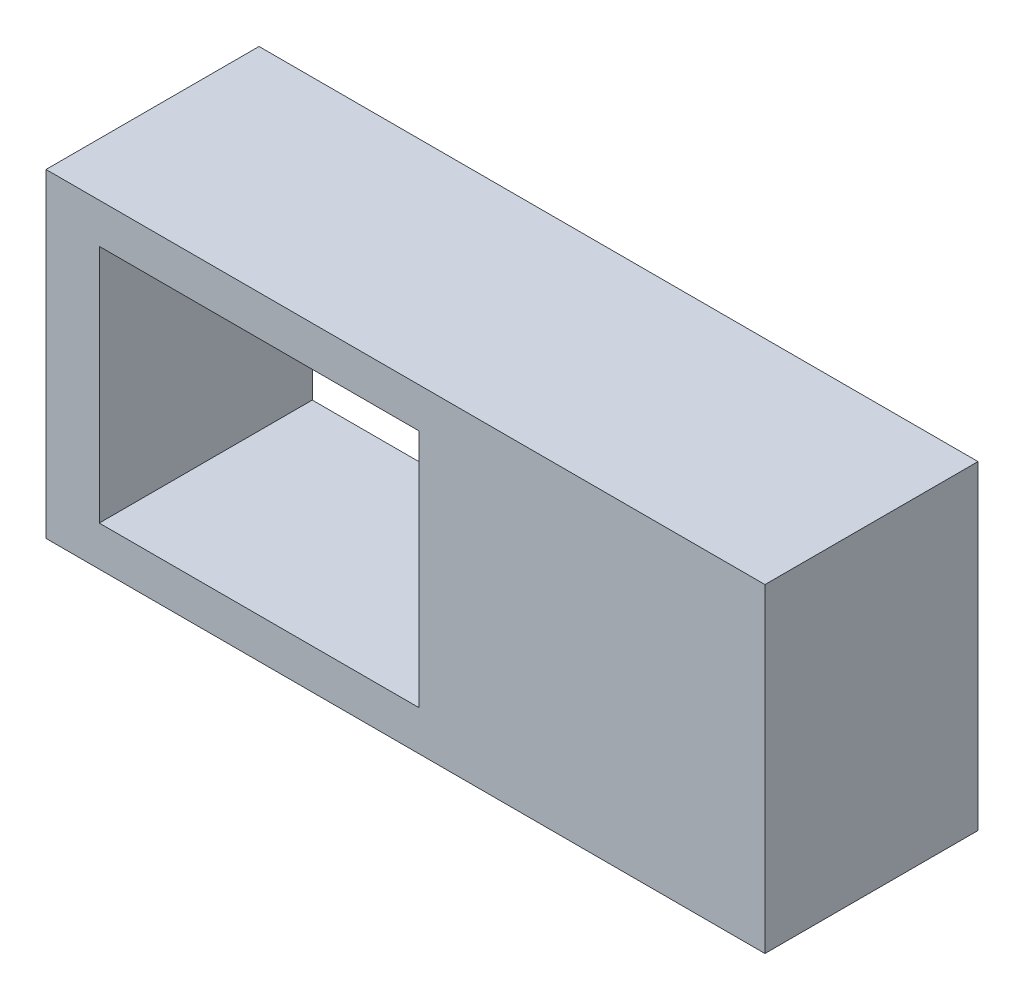
ISO-10303-21;
HEADER;
FILE_DESCRIPTION(('STEP AP214'),'2;1');
FILE_NAME('part.step','',(''),(''),'','','');
FILE_SCHEMA(('AUTOMOTIVE_DESIGN { 1 0 10303 214 1 1 1 1 }'));
ENDSEC;
DATA;
#1=APPLICATION_CONTEXT('core data for automotive mechanical design processes');
#2=APPLICATION_PROTOCOL_DEFINITION('international standard','automotive_design',2000,#1);
#3=PRODUCT_CONTEXT('',#1,'mechanical');
#4=PRODUCT('Part','Part','',(#3));
#5=PRODUCT_RELATED_PRODUCT_CATEGORY('part','',(#4));
#6=PRODUCT_DEFINITION_FORMATION('','',#4);
#7=PRODUCT_DEFINITION_CONTEXT('part definition',#1,'design');
#8=PRODUCT_DEFINITION('design','',#6,#7);
#9=PRODUCT_DEFINITION_SHAPE('','',#8);
#10=(LENGTH_UNIT() NAMED_UNIT(*) SI_UNIT(.MILLI.,.METRE.));
#11=(NAMED_UNIT(*) PLANE_ANGLE_UNIT() SI_UNIT($,.RADIAN.));
#12=(NAMED_UNIT(*) SI_UNIT($,.STERADIAN.) SOLID_ANGLE_UNIT());
#13=UNCERTAINTY_MEASURE_WITH_UNIT(LENGTH_MEASURE(1.E-05),#10,'distance_accuracy_value','');
#14=(GEOMETRIC_REPRESENTATION_CONTEXT(3) GLOBAL_UNCERTAINTY_ASSIGNED_CONTEXT((#13)) GLOBAL_UNIT_ASSIGNED_CONTEXT((#10,
#11,#12)) REPRESENTATION_CONTEXT('',''));
#15=CARTESIAN_POINT('',(0.,0.,0.));
#16=DIRECTION('',(0.,0.,1.));
#17=DIRECTION('',(1.,0.,0.));
#18=AXIS2_PLACEMENT_3D('',#15,#16,#17);
#19=CARTESIAN_POINT('',(0.,0.,8.));
#20=DIRECTION('',(0.,0.,1.));
#21=DIRECTION('',(1.,0.,0.));
#22=AXIS2_PLACEMENT_3D('',#19,#20,#21);
#23=PLANE('',#22);
#24=DIRECTION('',(-1.,0.,0.));
#25=VECTOR('',#24,1.);
#26=CARTESIAN_POINT('',(-11.5,4.5,8.));
#27=LINE('',#26,#25);
#28=CARTESIAN_POINT('',(0.500000000000002,4.5,8.));
#29=VERTEX_POINT('',#28);
#30=CARTESIAN_POINT('',(-11.5,4.5,8.));
#31=VERTEX_POINT('',#30);
#32=EDGE_CURVE('E108',#29,#31,#27,.T.);
#33=ORIENTED_EDGE('',*,*,#32,.F.);
#34=DIRECTION('',(0.,-1.,0.));
#35=VECTOR('',#34,1.);
#36=CARTESIAN_POINT('',(0.500000000000002,4.5,8.));
#37=LINE('',#36,#35);
#38=CARTESIAN_POINT('',(0.500000000000002,-4.5,8.));
#39=VERTEX_POINT('',#38);
#40=EDGE_CURVE('E354',#29,#39,#37,.T.);
#41=ORIENTED_EDGE('',*,*,#40,.T.);
#42=DIRECTION('',(1.,0.,0.));
#43=VECTOR('',#42,1.);
#44=CARTESIAN_POINT('',(-11.5,-4.5,8.));
#45=LINE('',#44,#43);
#46=CARTESIAN_POINT('',(-11.5,-4.5,8.));
#47=VERTEX_POINT('',#46);
#48=EDGE_CURVE('E132',#47,#39,#45,.T.);
#49=ORIENTED_EDGE('',*,*,#48,.F.);
#50=DIRECTION('',(0.,-1.,0.));
#51=VECTOR('',#50,1.);
#52=CARTESIAN_POINT('',(-11.5,4.5,8.));
#53=LINE('',#52,#51);
#54=EDGE_CURVE('E118',#31,#47,#53,.T.);
#55=ORIENTED_EDGE('',*,*,#54,.F.);
#56=EDGE_LOOP('',(#33,#41,#49,#55));
#57=FACE_BOUND('',#56,.T.);
#58=DIRECTION('',(0.,1.,0.));
#59=VECTOR('',#58,1.);
#60=CARTESIAN_POINT('',(13.5,6.,8.));
#61=LINE('',#60,#59);
#62=CARTESIAN_POINT('',(13.5,-6.,8.));
#63=VERTEX_POINT('',#62);
#64=CARTESIAN_POINT('',(13.5,6.,8.));
#65=VERTEX_POINT('',#64);
#66=EDGE_CURVE('E151',#63,#65,#61,.T.);
#67=ORIENTED_EDGE('',*,*,#66,.T.);
#68=DIRECTION('',(-1.,0.,0.));
#69=VECTOR('',#68,1.);
#70=CARTESIAN_POINT('',(-13.5,6.,8.));
#71=LINE('',#70,#69);
#72=CARTESIAN_POINT('',(-13.5,6.,8.));
#73=VERTEX_POINT('',#72);
#74=EDGE_CURVE('E154',#65,#73,#71,.T.);
#75=ORIENTED_EDGE('',*,*,#74,.T.);
#76=DIRECTION('',(0.,-1.,0.));
#77=VECTOR('',#76,1.);
#78=CARTESIAN_POINT('',(-13.5,6.,8.));
#79=LINE('',#78,#77);
#80=CARTESIAN_POINT('',(-13.5,-6.,8.));
#81=VERTEX_POINT('',#80);
#82=EDGE_CURVE('E157',#73,#81,#79,.T.);
#83=ORIENTED_EDGE('',*,*,#82,.T.);
#84=DIRECTION('',(1.,0.,0.));
#85=VECTOR('',#84,1.);
#86=CARTESIAN_POINT('',(-13.5,-6.,8.));
#87=LINE('',#86,#85);
#88=EDGE_CURVE('E159',#81,#63,#87,.T.);
#89=ORIENTED_EDGE('',*,*,#88,.T.);
#90=EDGE_LOOP('',(#67,#75,#83,#89));
#91=FACE_BOUND('',#90,.T.);
#92=ADVANCED_FACE('F35',(#57,#91),#23,.T.);
#93=CARTESIAN_POINT('',(0.,0.,0.));
#94=DIRECTION('',(0.,0.,1.));
#95=DIRECTION('',(1.,0.,0.));
#96=AXIS2_PLACEMENT_3D('',#93,#94,#95);
#97=PLANE('',#96);
#98=DIRECTION('',(0.,1.,0.));
#99=VECTOR('',#98,1.);
#100=CARTESIAN_POINT('',(13.5,6.,0.));
#101=LINE('',#100,#99);
#102=CARTESIAN_POINT('',(13.5,-6.,0.));
#103=VERTEX_POINT('',#102);
#104=CARTESIAN_POINT('',(13.5,6.,0.));
#105=VERTEX_POINT('',#104);
#106=EDGE_CURVE('E150',#103,#105,#101,.T.);
#107=ORIENTED_EDGE('',*,*,#106,.F.);
#108=DIRECTION('',(1.,0.,0.));
#109=VECTOR('',#108,1.);
#110=CARTESIAN_POINT('',(-13.5,-6.,0.));
#111=LINE('',#110,#109);
#112=CARTESIAN_POINT('',(-13.5,-6.,0.));
#113=VERTEX_POINT('',#112);
#114=EDGE_CURVE('E155',#113,#103,#111,.T.);
#115=ORIENTED_EDGE('',*,*,#114,.F.);
#116=DIRECTION('',(0.,-1.,0.));
#117=VECTOR('',#116,1.);
#118=CARTESIAN_POINT('',(-13.5,6.,0.));
#119=LINE('',#118,#117);
#120=CARTESIAN_POINT('',(-13.5,6.,0.));
#121=VERTEX_POINT('',#120);
#122=EDGE_CURVE('E166',#121,#113,#119,.T.);
#123=ORIENTED_EDGE('',*,*,#122,.F.);
#124=DIRECTION('',(-1.,0.,0.));
#125=VECTOR('',#124,1.);
#126=CARTESIAN_POINT('',(-13.5,6.,0.));
#127=LINE('',#126,#125);
#128=EDGE_CURVE('E164',#105,#121,#127,.T.);
#129=ORIENTED_EDGE('',*,*,#128,.F.);
#130=EDGE_LOOP('',(#107,#115,#123,#129));
#131=FACE_BOUND('',#130,.T.);
#132=DIRECTION('',(0.,1.,0.));
#133=VECTOR('',#132,1.);
#134=CARTESIAN_POINT('',(11.5,4.5,0.));
#135=LINE('',#134,#133);
#136=CARTESIAN_POINT('',(11.5,-4.5,0.));
#137=VERTEX_POINT('',#136);
#138=CARTESIAN_POINT('',(11.5,4.5,0.));
#139=VERTEX_POINT('',#138);
#140=EDGE_CURVE('E138',#137,#139,#135,.T.);
#141=ORIENTED_EDGE('',*,*,#140,.T.);
#142=DIRECTION('',(-1.,0.,0.));
#143=VECTOR('',#142,1.);
#144=CARTESIAN_POINT('',(-11.5,4.5,0.));
#145=LINE('',#144,#143);
#146=CARTESIAN_POINT('',(-11.5,4.5,0.));
#147=VERTEX_POINT('',#146);
#148=EDGE_CURVE('E141',#139,#147,#145,.T.);
#149=ORIENTED_EDGE('',*,*,#148,.T.);
#150=DIRECTION('',(0.,-1.,0.));
#151=VECTOR('',#150,1.);
#152=CARTESIAN_POINT('',(-11.5,4.5,0.));
#153=LINE('',#152,#151);
#154=CARTESIAN_POINT('',(-11.5,-4.5,0.));
#155=VERTEX_POINT('',#154);
#156=EDGE_CURVE('E126',#147,#155,#153,.T.);
#157=ORIENTED_EDGE('',*,*,#156,.T.);
#158=DIRECTION('',(1.,0.,0.));
#159=VECTOR('',#158,1.);
#160=CARTESIAN_POINT('',(-11.5,-4.5,0.));
#161=LINE('',#160,#159);
#162=EDGE_CURVE('E119',#155,#137,#161,.T.);
#163=ORIENTED_EDGE('',*,*,#162,.T.);
#164=EDGE_LOOP('',(#141,#149,#157,#163));
#165=FACE_BOUND('',#164,.T.);
#166=ADVANCED_FACE('F187',(#131,#165),#97,.F.);
#167=CARTESIAN_POINT('',(13.5,6.,8.));
#168=DIRECTION('',(-1.,0.,0.));
#169=DIRECTION('',(0.,-1.,0.));
#170=AXIS2_PLACEMENT_3D('',#167,#168,#169);
#171=PLANE('',#170);
#172=ORIENTED_EDGE('',*,*,#106,.T.);
#173=DIRECTION('',(0.,0.,-1.));
#174=VECTOR('',#173,1.);
#175=CARTESIAN_POINT('',(13.5,6.,8.));
#176=LINE('',#175,#174);
#177=EDGE_CURVE('E43',#65,#105,#176,.T.);
#178=ORIENTED_EDGE('',*,*,#177,.F.);
#179=ORIENTED_EDGE('',*,*,#66,.F.);
#180=DIRECTION('',(0.,0.,-1.));
#181=VECTOR('',#180,1.);
#182=CARTESIAN_POINT('',(13.5,-6.,8.));
#183=LINE('',#182,#181);
#184=EDGE_CURVE('E161',#63,#103,#183,.T.);
#185=ORIENTED_EDGE('',*,*,#184,.T.);
#186=EDGE_LOOP('',(#172,#178,#179,#185));
#187=FACE_BOUND('',#186,.T.);
#188=ADVANCED_FACE('F37',(#187),#171,.F.);
#189=CARTESIAN_POINT('',(-13.5,6.,8.));
#190=DIRECTION('',(0.,-1.,0.));
#191=DIRECTION('',(0.,0.,-1.));
#192=AXIS2_PLACEMENT_3D('',#189,#190,#191);
#193=PLANE('',#192);
#194=ORIENTED_EDGE('',*,*,#128,.T.);
#195=DIRECTION('',(0.,0.,-1.));
#196=VECTOR('',#195,1.);
#197=CARTESIAN_POINT('',(-13.5,6.,8.));
#198=LINE('',#197,#196);
#199=EDGE_CURVE('E174',#73,#121,#198,.T.);
#200=ORIENTED_EDGE('',*,*,#199,.F.);
#201=ORIENTED_EDGE('',*,*,#74,.F.);
#202=ORIENTED_EDGE('',*,*,#177,.T.);
#203=EDGE_LOOP('',(#194,#200,#201,#202));
#204=FACE_BOUND('',#203,.T.);
#205=ADVANCED_FACE('F179',(#204),#193,.F.);
#206=CARTESIAN_POINT('',(-13.5,6.,8.));
#207=DIRECTION('',(1.,0.,0.));
#208=DIRECTION('',(0.,0.,-1.));
#209=AXIS2_PLACEMENT_3D('',#206,#207,#208);
#210=PLANE('',#209);
#211=ORIENTED_EDGE('',*,*,#122,.T.);
#212=DIRECTION('',(0.,0.,-1.));
#213=VECTOR('',#212,1.);
#214=CARTESIAN_POINT('',(-13.5,-6.,8.));
#215=LINE('',#214,#213);
#216=EDGE_CURVE('E171',#81,#113,#215,.T.);
#217=ORIENTED_EDGE('',*,*,#216,.F.);
#218=ORIENTED_EDGE('',*,*,#82,.F.);
#219=ORIENTED_EDGE('',*,*,#199,.T.);
#220=EDGE_LOOP('',(#211,#217,#218,#219));
#221=FACE_BOUND('',#220,.T.);
#222=ADVANCED_FACE('F192',(#221),#210,.F.);
#223=CARTESIAN_POINT('',(-13.5,-6.,8.));
#224=DIRECTION('',(0.,1.,0.));
#225=DIRECTION('',(0.,0.,1.));
#226=AXIS2_PLACEMENT_3D('',#223,#224,#225);
#227=PLANE('',#226);
#228=ORIENTED_EDGE('',*,*,#114,.T.);
#229=ORIENTED_EDGE('',*,*,#184,.F.);
#230=ORIENTED_EDGE('',*,*,#88,.F.);
#231=ORIENTED_EDGE('',*,*,#216,.T.);
#232=EDGE_LOOP('',(#228,#229,#230,#231));
#233=FACE_BOUND('',#232,.T.);
#234=ADVANCED_FACE('F196',(#233),#227,.F.);
#235=CARTESIAN_POINT('',(11.5,4.5,8.));
#236=DIRECTION('',(-1.,0.,0.));
#237=DIRECTION('',(0.,0.,1.));
#238=AXIS2_PLACEMENT_3D('',#235,#236,#237);
#239=PLANE('',#238);
#240=DIRECTION('',(0.,1.,0.));
#241=VECTOR('',#240,1.);
#242=CARTESIAN_POINT('',(11.5,4.5,6.));
#243=LINE('',#242,#241);
#244=CARTESIAN_POINT('',(11.5,-4.5,6.));
#245=VERTEX_POINT('',#244);
#246=CARTESIAN_POINT('',(11.5,4.5,6.));
#247=VERTEX_POINT('',#246);
#248=EDGE_CURVE('E356',#245,#247,#243,.T.);
#249=ORIENTED_EDGE('',*,*,#248,.T.);
#250=DIRECTION('',(0.,0.,-1.));
#251=VECTOR('',#250,1.);
#252=CARTESIAN_POINT('',(11.5,4.5,8.));
#253=LINE('',#252,#251);
#254=EDGE_CURVE('E128',#247,#139,#253,.T.);
#255=ORIENTED_EDGE('',*,*,#254,.T.);
#256=ORIENTED_EDGE('',*,*,#140,.F.);
#257=DIRECTION('',(0.,0.,-1.));
#258=VECTOR('',#257,1.);
#259=CARTESIAN_POINT('',(11.5,-4.5,8.));
#260=LINE('',#259,#258);
#261=EDGE_CURVE('E134',#245,#137,#260,.T.);
#262=ORIENTED_EDGE('',*,*,#261,.F.);
#263=EDGE_LOOP('',(#249,#255,#256,#262));
#264=FACE_BOUND('',#263,.T.);
#265=ADVANCED_FACE('F204',(#264),#239,.T.);
#266=CARTESIAN_POINT('',(-11.5,4.5,8.));
#267=DIRECTION('',(0.,-1.,0.));
#268=DIRECTION('',(0.,0.,-1.));
#269=AXIS2_PLACEMENT_3D('',#266,#267,#268);
#270=PLANE('',#269);
#271=DIRECTION('',(0.,0.,1.));
#272=VECTOR('',#271,1.);
#273=CARTESIAN_POINT('',(0.500000000000002,4.5,6.));
#274=LINE('',#273,#272);
#275=CARTESIAN_POINT('',(0.500000000000002,4.5,6.));
#276=VERTEX_POINT('',#275);
#277=EDGE_CURVE('E54',#276,#29,#274,.T.);
#278=ORIENTED_EDGE('',*,*,#277,.T.);
#279=ORIENTED_EDGE('',*,*,#32,.T.);
#280=DIRECTION('',(0.,0.,-1.));
#281=VECTOR('',#280,1.);
#282=CARTESIAN_POINT('',(-11.5,4.5,8.));
#283=LINE('',#282,#281);
#284=EDGE_CURVE('E112',#31,#147,#283,.T.);
#285=ORIENTED_EDGE('',*,*,#284,.T.);
#286=ORIENTED_EDGE('',*,*,#148,.F.);
#287=ORIENTED_EDGE('',*,*,#254,.F.);
#288=DIRECTION('',(-1.,0.,0.));
#289=VECTOR('',#288,1.);
#290=CARTESIAN_POINT('',(11.5,4.5,6.));
#291=LINE('',#290,#289);
#292=EDGE_CURVE('E50',#247,#276,#291,.T.);
#293=ORIENTED_EDGE('',*,*,#292,.T.);
#294=EDGE_LOOP('',(#278,#279,#285,#286,#287,#293));
#295=FACE_BOUND('',#294,.T.);
#296=ADVANCED_FACE('F110',(#295),#270,.T.);
#297=CARTESIAN_POINT('',(-11.5,4.5,8.));
#298=DIRECTION('',(1.,0.,0.));
#299=DIRECTION('',(0.,0.,-1.));
#300=AXIS2_PLACEMENT_3D('',#297,#298,#299);
#301=PLANE('',#300);
#302=ORIENTED_EDGE('',*,*,#156,.F.);
#303=ORIENTED_EDGE('',*,*,#284,.F.);
#304=ORIENTED_EDGE('',*,*,#54,.T.);
#305=DIRECTION('',(0.,0.,-1.));
#306=VECTOR('',#305,1.);
#307=CARTESIAN_POINT('',(-11.5,-4.5,8.));
#308=LINE('',#307,#306);
#309=EDGE_CURVE('E129',#47,#155,#308,.T.);
#310=ORIENTED_EDGE('',*,*,#309,.T.);
#311=EDGE_LOOP('',(#302,#303,#304,#310));
#312=FACE_BOUND('',#311,.T.);
#313=ADVANCED_FACE('F123',(#312),#301,.T.);
#314=CARTESIAN_POINT('',(-11.5,-4.5,8.));
#315=DIRECTION('',(0.,1.,0.));
#316=DIRECTION('',(0.,0.,1.));
#317=AXIS2_PLACEMENT_3D('',#314,#315,#316);
#318=PLANE('',#317);
#319=DIRECTION('',(0.,0.,1.));
#320=VECTOR('',#319,1.);
#321=CARTESIAN_POINT('',(0.500000000000004,-4.5,6.));
#322=LINE('',#321,#320);
#323=CARTESIAN_POINT('',(0.500000000000002,-4.5,6.));
#324=VERTEX_POINT('',#323);
#325=EDGE_CURVE('E142',#324,#39,#322,.T.);
#326=ORIENTED_EDGE('',*,*,#325,.F.);
#327=DIRECTION('',(1.,0.,0.));
#328=VECTOR('',#327,1.);
#329=CARTESIAN_POINT('',(11.5,-4.5,6.));
#330=LINE('',#329,#328);
#331=EDGE_CURVE('E362',#324,#245,#330,.T.);
#332=ORIENTED_EDGE('',*,*,#331,.T.);
#333=ORIENTED_EDGE('',*,*,#261,.T.);
#334=ORIENTED_EDGE('',*,*,#162,.F.);
#335=ORIENTED_EDGE('',*,*,#309,.F.);
#336=ORIENTED_EDGE('',*,*,#48,.T.);
#337=EDGE_LOOP('',(#326,#332,#333,#334,#335,#336));
#338=FACE_BOUND('',#337,.T.);
#339=ADVANCED_FACE('F264',(#338),#318,.T.);
#340=CARTESIAN_POINT('',(0.500000000000002,4.5,6.));
#341=DIRECTION('',(-1.,0.,0.));
#342=DIRECTION('',(0.,-1.,0.));
#343=AXIS2_PLACEMENT_3D('',#340,#341,#342);
#344=PLANE('',#343);
#345=ORIENTED_EDGE('',*,*,#40,.F.);
#346=ORIENTED_EDGE('',*,*,#277,.F.);
#347=DIRECTION('',(0.,-1.,0.));
#348=VECTOR('',#347,1.);
#349=CARTESIAN_POINT('',(0.500000000000002,4.5,6.));
#350=LINE('',#349,#348);
#351=EDGE_CURVE('E359',#276,#324,#350,.T.);
#352=ORIENTED_EDGE('',*,*,#351,.T.);
#353=ORIENTED_EDGE('',*,*,#325,.T.);
#354=EDGE_LOOP('',(#345,#346,#352,#353));
#355=FACE_BOUND('',#354,.T.);
#356=ADVANCED_FACE('F270',(#355),#344,.T.);
#357=CARTESIAN_POINT('',(0.,0.,6.));
#358=DIRECTION('',(0.,0.,-1.));
#359=DIRECTION('',(-1.,0.,0.));
#360=AXIS2_PLACEMENT_3D('',#357,#358,#359);
#361=PLANE('',#360);
#362=CARTESIAN_POINT('',(6.35,0.,6.));
#363=DIRECTION('',(0.,0.,-1.));
#364=DIRECTION('',(-1.,0.,0.));
#365=AXIS2_PLACEMENT_3D('',#362,#363,#364);
#366=CIRCLE('',#365,2.75);
#367=CARTESIAN_POINT('',(3.6,0.,6.));
#368=VERTEX_POINT('',#367);
#369=EDGE_CURVE('E347',#368,#368,#366,.T.);
#370=ORIENTED_EDGE('',*,*,#369,.F.);
#371=EDGE_LOOP('',(#370));
#372=FACE_BOUND('',#371,.T.);
#373=ORIENTED_EDGE('',*,*,#248,.F.);
#374=ORIENTED_EDGE('',*,*,#331,.F.);
#375=ORIENTED_EDGE('',*,*,#351,.F.);
#376=ORIENTED_EDGE('',*,*,#292,.F.);
#377=EDGE_LOOP('',(#373,#374,#375,#376));
#378=FACE_BOUND('',#377,.T.);
#379=ADVANCED_FACE('F283',(#372,#378),#361,.T.);
#380=CARTESIAN_POINT('',(6.35,0.,1.));
#381=DIRECTION('',(0.,0.,-1.));
#382=DIRECTION('',(-1.,0.,0.));
#383=AXIS2_PLACEMENT_3D('',#380,#381,#382);
#384=PLANE('',#383);
#385=CARTESIAN_POINT('',(6.35,0.,1.));
#386=DIRECTION('',(0.,0.,-1.));
#387=DIRECTION('',(-1.,0.,0.));
#388=AXIS2_PLACEMENT_3D('',#385,#386,#387);
#389=CIRCLE('',#388,2.75);
#390=CARTESIAN_POINT('',(3.6,0.,1.));
#391=VERTEX_POINT('',#390);
#392=EDGE_CURVE('E350',#391,#391,#389,.T.);
#393=ORIENTED_EDGE('',*,*,#392,.T.);
#394=EDGE_LOOP('',(#393));
#395=FACE_BOUND('',#394,.T.);
#396=CARTESIAN_POINT('',(6.35,0.,1.));
#397=DIRECTION('',(0.,0.,-1.));
#398=DIRECTION('',(-1.,0.,0.));
#399=AXIS2_PLACEMENT_3D('',#396,#397,#398);
#400=CIRCLE('',#399,1.55);
#401=CARTESIAN_POINT('',(4.8,0.,1.));
#402=VERTEX_POINT('',#401);
#403=EDGE_CURVE('E344',#402,#402,#400,.T.);
#404=ORIENTED_EDGE('',*,*,#403,.F.);
#405=EDGE_LOOP('',(#404));
#406=FACE_BOUND('',#405,.T.);
#407=ADVANCED_FACE('F292',(#395,#406),#384,.T.);
#408=CARTESIAN_POINT('',(6.35,0.,1.));
#409=DIRECTION('',(0.,0.,1.));
#410=DIRECTION('',(1.,0.,0.));
#411=AXIS2_PLACEMENT_3D('',#408,#409,#410);
#412=CYLINDRICAL_SURFACE('',#411,2.75);
#413=ORIENTED_EDGE('',*,*,#392,.F.);
#414=EDGE_LOOP('',(#413));
#415=FACE_BOUND('',#414,.T.);
#416=ORIENTED_EDGE('',*,*,#369,.T.);
#417=EDGE_LOOP('',(#416));
#418=FACE_BOUND('',#417,.T.);
#419=ADVANCED_FACE('F311',(#415,#418),#412,.T.);
#420=CARTESIAN_POINT('',(6.35,0.,1.));
#421=DIRECTION('',(0.,0.,1.));
#422=DIRECTION('',(1.,0.,0.));
#423=AXIS2_PLACEMENT_3D('',#420,#421,#422);
#424=CYLINDRICAL_SURFACE('',#423,1.55);
#425=ORIENTED_EDGE('',*,*,#403,.T.);
#426=EDGE_LOOP('',(#425));
#427=FACE_BOUND('',#426,.T.);
#428=CARTESIAN_POINT('',(6.35,0.,6.));
#429=DIRECTION('',(0.,0.,-1.));
#430=DIRECTION('',(-1.,0.,0.));
#431=AXIS2_PLACEMENT_3D('',#428,#429,#430);
#432=CIRCLE('',#431,1.55);
#433=CARTESIAN_POINT('',(4.8,0.,6.));
#434=VERTEX_POINT('',#433);
#435=EDGE_CURVE('E11',#434,#434,#432,.F.);
#436=ORIENTED_EDGE('',*,*,#435,.T.);
#437=EDGE_LOOP('',(#436));
#438=FACE_BOUND('',#437,.T.);
#439=ADVANCED_FACE('F303',(#427,#438),#424,.F.);
#440=ORIENTED_EDGE('',*,*,#435,.F.);
#441=EDGE_LOOP('',(#440));
#442=FACE_BOUND('',#441,.T.);
#443=ADVANCED_FACE('F295',(#442),#361,.T.);
#444=CLOSED_SHELL('',(#92,#166,#188,#205,#222,#234,#265,#296,#313,#339,#356,#379,#407,#419,#439,#443));
#445=MANIFOLD_SOLID_BREP('B2',#444);
#446=ADVANCED_BREP_SHAPE_REPRESENTATION('',(#18,#445),#14);
#447=SHAPE_DEFINITION_REPRESENTATION(#9,#446);
ENDSEC;
END-ISO-10303-21;
